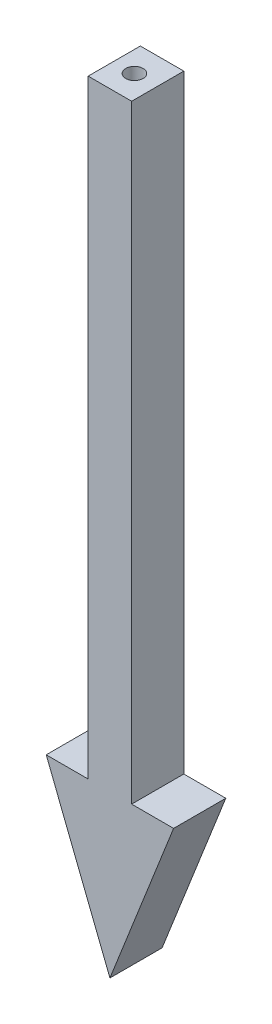
ISO-10303-21;
HEADER;
FILE_DESCRIPTION(('STEP AP214'),'2;1');
FILE_NAME('part.step','',(''),(''),'','','');
FILE_SCHEMA(('AUTOMOTIVE_DESIGN { 1 0 10303 214 1 1 1 1 }'));
ENDSEC;
DATA;
#1=APPLICATION_CONTEXT('core data for automotive mechanical design processes');
#2=APPLICATION_PROTOCOL_DEFINITION('international standard','automotive_design',2000,#1);
#3=PRODUCT_CONTEXT('',#1,'mechanical');
#4=PRODUCT('Part','Part','',(#3));
#5=PRODUCT_RELATED_PRODUCT_CATEGORY('part','',(#4));
#6=PRODUCT_DEFINITION_FORMATION('','',#4);
#7=PRODUCT_DEFINITION_CONTEXT('part definition',#1,'design');
#8=PRODUCT_DEFINITION('design','',#6,#7);
#9=PRODUCT_DEFINITION_SHAPE('','',#8);
#10=(LENGTH_UNIT() NAMED_UNIT(*) SI_UNIT(.MILLI.,.METRE.));
#11=(NAMED_UNIT(*) PLANE_ANGLE_UNIT() SI_UNIT($,.RADIAN.));
#12=(NAMED_UNIT(*) SI_UNIT($,.STERADIAN.) SOLID_ANGLE_UNIT());
#13=UNCERTAINTY_MEASURE_WITH_UNIT(LENGTH_MEASURE(1.E-05),#10,'distance_accuracy_value','');
#14=(GEOMETRIC_REPRESENTATION_CONTEXT(3) GLOBAL_UNCERTAINTY_ASSIGNED_CONTEXT((#13)) GLOBAL_UNIT_ASSIGNED_CONTEXT((#10,
#11,#12)) REPRESENTATION_CONTEXT('',''));
#15=CARTESIAN_POINT('',(0.,0.,0.));
#16=DIRECTION('',(0.,0.,1.));
#17=DIRECTION('',(1.,0.,0.));
#18=AXIS2_PLACEMENT_3D('',#15,#16,#17);
#19=CARTESIAN_POINT('',(-9.54116550646308,105.498159977998,12.));
#20=DIRECTION('',(0.,-1.,0.));
#21=DIRECTION('',(0.,0.,-1.));
#22=AXIS2_PLACEMENT_3D('',#19,#20,#21);
#23=PLANE('',#22);
#24=CARTESIAN_POINT('',(-4.74588635269599,105.498159977998,6.15354063467408));
#25=DIRECTION('',(0.,1.,0.));
#26=DIRECTION('',(0.,0.,1.));
#27=AXIS2_PLACEMENT_3D('',#24,#25,#26);
#28=CIRCLE('',#27,2.);
#29=CARTESIAN_POINT('',(-4.74588635269599,105.498159977998,8.15354063467408));
#30=VERTEX_POINT('',#29);
#31=EDGE_CURVE('E159',#30,#30,#28,.T.);
#32=ORIENTED_EDGE('',*,*,#31,.F.);
#33=EDGE_LOOP('',(#32));
#34=FACE_BOUND('',#33,.T.);
#35=DIRECTION('',(-1.,0.,0.));
#36=VECTOR('',#35,1.);
#37=CARTESIAN_POINT('',(-9.54116550646308,105.498159977998,0.));
#38=LINE('',#37,#36);
#39=CARTESIAN_POINT('',(0.458834493536922,105.498159977998,0.));
#40=VERTEX_POINT('',#39);
#41=CARTESIAN_POINT('',(-9.54116550646308,105.498159977998,0.));
#42=VERTEX_POINT('',#41);
#43=EDGE_CURVE('E124',#40,#42,#38,.T.);
#44=ORIENTED_EDGE('',*,*,#43,.T.);
#45=DIRECTION('',(0.,0.,-1.));
#46=VECTOR('',#45,1.);
#47=CARTESIAN_POINT('',(-9.54116550646308,105.498159977998,12.));
#48=LINE('',#47,#46);
#49=CARTESIAN_POINT('',(-9.54116550646308,105.498159977998,12.));
#50=VERTEX_POINT('',#49);
#51=EDGE_CURVE('E11',#50,#42,#48,.T.);
#52=ORIENTED_EDGE('',*,*,#51,.F.);
#53=DIRECTION('',(-1.,0.,0.));
#54=VECTOR('',#53,1.);
#55=CARTESIAN_POINT('',(-9.54116550646308,105.498159977998,12.));
#56=LINE('',#55,#54);
#57=CARTESIAN_POINT('',(0.458834493536922,105.498159977998,12.));
#58=VERTEX_POINT('',#57);
#59=EDGE_CURVE('E138',#58,#50,#56,.T.);
#60=ORIENTED_EDGE('',*,*,#59,.F.);
#61=DIRECTION('',(0.,0.,-1.));
#62=VECTOR('',#61,1.);
#63=CARTESIAN_POINT('',(0.458834493536922,105.498159977998,12.));
#64=LINE('',#63,#62);
#65=EDGE_CURVE('E120',#58,#40,#64,.T.);
#66=ORIENTED_EDGE('',*,*,#65,.T.);
#67=EDGE_LOOP('',(#44,#52,#60,#66));
#68=FACE_BOUND('',#67,.T.);
#69=ADVANCED_FACE('F33',(#34,#68),#23,.F.);
#70=CARTESIAN_POINT('',(-9.54116550646308,95.4981599779981,12.));
#71=DIRECTION('',(1.,0.,0.));
#72=DIRECTION('',(0.,0.,-1.));
#73=AXIS2_PLACEMENT_3D('',#70,#71,#72);
#74=PLANE('',#73);
#75=DIRECTION('',(0.,-1.,0.));
#76=VECTOR('',#75,1.);
#77=CARTESIAN_POINT('',(-9.54116550646308,95.4981599779981,0.));
#78=LINE('',#77,#76);
#79=CARTESIAN_POINT('',(-9.54116550646308,-34.5018400220019,0.));
#80=VERTEX_POINT('',#79);
#81=EDGE_CURVE('E127',#42,#80,#78,.T.);
#82=ORIENTED_EDGE('',*,*,#81,.T.);
#83=DIRECTION('',(0.,0.,-1.));
#84=VECTOR('',#83,1.);
#85=CARTESIAN_POINT('',(-9.54116550646308,-34.5018400220019,12.));
#86=LINE('',#85,#84);
#87=CARTESIAN_POINT('',(-9.54116550646308,-34.5018400220019,12.));
#88=VERTEX_POINT('',#87);
#89=EDGE_CURVE('E41',#88,#80,#86,.T.);
#90=ORIENTED_EDGE('',*,*,#89,.F.);
#91=DIRECTION('',(0.,-1.,0.));
#92=VECTOR('',#91,1.);
#93=CARTESIAN_POINT('',(-9.54116550646308,105.498159977998,12.));
#94=LINE('',#93,#92);
#95=EDGE_CURVE('E87',#50,#88,#94,.T.);
#96=ORIENTED_EDGE('',*,*,#95,.F.);
#97=ORIENTED_EDGE('',*,*,#51,.T.);
#98=EDGE_LOOP('',(#82,#90,#96,#97));
#99=FACE_BOUND('',#98,.T.);
#100=ADVANCED_FACE('F175',(#99),#74,.F.);
#101=CARTESIAN_POINT('',(-19.1929369408072,-34.5018400220019,12.));
#102=DIRECTION('',(0.,-1.,0.));
#103=DIRECTION('',(1.,0.,0.));
#104=AXIS2_PLACEMENT_3D('',#101,#102,#103);
#105=PLANE('',#104);
#106=DIRECTION('',(-1.,0.,0.));
#107=VECTOR('',#106,1.);
#108=CARTESIAN_POINT('',(-19.1929369408072,-34.5018400220019,0.));
#109=LINE('',#108,#107);
#110=CARTESIAN_POINT('',(-19.1929369408072,-34.5018400220019,0.));
#111=VERTEX_POINT('',#110);
#112=EDGE_CURVE('E130',#80,#111,#109,.T.);
#113=ORIENTED_EDGE('',*,*,#112,.T.);
#114=DIRECTION('',(0.,0.,-1.));
#115=VECTOR('',#114,1.);
#116=CARTESIAN_POINT('',(-19.1929369408072,-34.5018400220019,12.));
#117=LINE('',#116,#115);
#118=CARTESIAN_POINT('',(-19.1929369408072,-34.5018400220019,12.));
#119=VERTEX_POINT('',#118);
#120=EDGE_CURVE('E142',#119,#111,#117,.T.);
#121=ORIENTED_EDGE('',*,*,#120,.F.);
#122=DIRECTION('',(-1.,0.,0.));
#123=VECTOR('',#122,1.);
#124=CARTESIAN_POINT('',(-19.1929369408072,-34.5018400220019,12.));
#125=LINE('',#124,#123);
#126=EDGE_CURVE('E150',#88,#119,#125,.T.);
#127=ORIENTED_EDGE('',*,*,#126,.F.);
#128=ORIENTED_EDGE('',*,*,#89,.T.);
#129=EDGE_LOOP('',(#113,#121,#127,#128));
#130=FACE_BOUND('',#129,.T.);
#131=ADVANCED_FACE('F148',(#130),#105,.F.);
#132=CARTESIAN_POINT('',(-19.1929369408072,-34.5018400220019,12.));
#133=DIRECTION('',(0.930197160943089,0.367060269946798,0.));
#134=DIRECTION('',(-0.367060269946798,0.93019716094309,0.));
#135=AXIS2_PLACEMENT_3D('',#132,#133,#134);
#136=PLANE('',#135);
#137=DIRECTION('',(0.367060269946798,-0.930197160943089,0.));
#138=VECTOR('',#137,1.);
#139=CARTESIAN_POINT('',(-19.1929369408072,-34.5018400220019,0.));
#140=LINE('',#139,#138);
#141=CARTESIAN_POINT('',(-4.54116550646308,-71.6320807669056,0.));
#142=VERTEX_POINT('',#141);
#143=EDGE_CURVE('E132',#111,#142,#140,.T.);
#144=ORIENTED_EDGE('',*,*,#143,.T.);
#145=DIRECTION('',(0.,0.,-1.));
#146=VECTOR('',#145,1.);
#147=CARTESIAN_POINT('',(-4.54116550646308,-71.6320807669056,12.));
#148=LINE('',#147,#146);
#149=CARTESIAN_POINT('',(-4.54116550646308,-71.6320807669056,12.));
#150=VERTEX_POINT('',#149);
#151=EDGE_CURVE('E115',#150,#142,#148,.T.);
#152=ORIENTED_EDGE('',*,*,#151,.F.);
#153=DIRECTION('',(0.367060269946798,-0.930197160943089,0.));
#154=VECTOR('',#153,1.);
#155=CARTESIAN_POINT('',(-19.1929369408072,-34.5018400220019,12.));
#156=LINE('',#155,#154);
#157=EDGE_CURVE('E104',#119,#150,#156,.T.);
#158=ORIENTED_EDGE('',*,*,#157,.F.);
#159=ORIENTED_EDGE('',*,*,#120,.T.);
#160=EDGE_LOOP('',(#144,#152,#158,#159));
#161=FACE_BOUND('',#160,.T.);
#162=ADVANCED_FACE('F154',(#161),#136,.F.);
#163=CARTESIAN_POINT('',(-4.54116550646308,-71.6320807669056,12.));
#164=DIRECTION('',(-0.930197160943089,0.367060269946798,0.));
#165=DIRECTION('',(-0.367060269946798,-0.930197160943089,0.));
#166=AXIS2_PLACEMENT_3D('',#163,#164,#165);
#167=PLANE('',#166);
#168=DIRECTION('',(0.367060269946798,0.930197160943089,0.));
#169=VECTOR('',#168,1.);
#170=CARTESIAN_POINT('',(-4.54116550646308,-71.6320807669056,0.));
#171=LINE('',#170,#169);
#172=CARTESIAN_POINT('',(10.1106059278811,-34.5018400220019,0.));
#173=VERTEX_POINT('',#172);
#174=EDGE_CURVE('E113',#142,#173,#171,.T.);
#175=ORIENTED_EDGE('',*,*,#174,.T.);
#176=DIRECTION('',(0.,0.,-1.));
#177=VECTOR('',#176,1.);
#178=CARTESIAN_POINT('',(10.1106059278811,-34.5018400220019,12.));
#179=LINE('',#178,#177);
#180=CARTESIAN_POINT('',(10.1106059278811,-34.5018400220019,12.));
#181=VERTEX_POINT('',#180);
#182=EDGE_CURVE('E110',#181,#173,#179,.T.);
#183=ORIENTED_EDGE('',*,*,#182,.F.);
#184=DIRECTION('',(0.367060269946798,0.930197160943089,0.));
#185=VECTOR('',#184,1.);
#186=CARTESIAN_POINT('',(-4.54116550646308,-71.6320807669056,12.));
#187=LINE('',#186,#185);
#188=EDGE_CURVE('E97',#150,#181,#187,.T.);
#189=ORIENTED_EDGE('',*,*,#188,.F.);
#190=ORIENTED_EDGE('',*,*,#151,.T.);
#191=EDGE_LOOP('',(#175,#183,#189,#190));
#192=FACE_BOUND('',#191,.T.);
#193=ADVANCED_FACE('F111',(#192),#167,.F.);
#194=CARTESIAN_POINT('',(0.458834493536922,-34.5018400220019,12.));
#195=DIRECTION('',(0.,-1.,0.));
#196=DIRECTION('',(0.,0.,-1.));
#197=AXIS2_PLACEMENT_3D('',#194,#195,#196);
#198=PLANE('',#197);
#199=DIRECTION('',(-1.,0.,0.));
#200=VECTOR('',#199,1.);
#201=CARTESIAN_POINT('',(0.458834493536922,-34.5018400220019,0.));
#202=LINE('',#201,#200);
#203=CARTESIAN_POINT('',(0.458834493536922,-34.5018400220019,0.));
#204=VERTEX_POINT('',#203);
#205=EDGE_CURVE('E135',#173,#204,#202,.T.);
#206=ORIENTED_EDGE('',*,*,#205,.T.);
#207=DIRECTION('',(0.,0.,-1.));
#208=VECTOR('',#207,1.);
#209=CARTESIAN_POINT('',(0.458834493536922,-34.5018400220019,12.));
#210=LINE('',#209,#208);
#211=CARTESIAN_POINT('',(0.458834493536922,-34.5018400220019,12.));
#212=VERTEX_POINT('',#211);
#213=EDGE_CURVE('E116',#212,#204,#210,.T.);
#214=ORIENTED_EDGE('',*,*,#213,.F.);
#215=DIRECTION('',(-1.,0.,0.));
#216=VECTOR('',#215,1.);
#217=CARTESIAN_POINT('',(0.458834493536922,-34.5018400220019,12.));
#218=LINE('',#217,#216);
#219=EDGE_CURVE('E101',#181,#212,#218,.T.);
#220=ORIENTED_EDGE('',*,*,#219,.F.);
#221=ORIENTED_EDGE('',*,*,#182,.T.);
#222=EDGE_LOOP('',(#206,#214,#220,#221));
#223=FACE_BOUND('',#222,.T.);
#224=ADVANCED_FACE('F118',(#223),#198,.F.);
#225=CARTESIAN_POINT('',(0.458834493536922,105.498159977998,12.));
#226=DIRECTION('',(-1.,0.,0.));
#227=DIRECTION('',(0.,0.,1.));
#228=AXIS2_PLACEMENT_3D('',#225,#226,#227);
#229=PLANE('',#228);
#230=DIRECTION('',(0.,1.,0.));
#231=VECTOR('',#230,1.);
#232=CARTESIAN_POINT('',(0.458834493536922,105.498159977998,0.));
#233=LINE('',#232,#231);
#234=EDGE_CURVE('E75',#204,#40,#233,.T.);
#235=ORIENTED_EDGE('',*,*,#234,.T.);
#236=ORIENTED_EDGE('',*,*,#65,.F.);
#237=DIRECTION('',(0.,1.,0.));
#238=VECTOR('',#237,1.);
#239=CARTESIAN_POINT('',(0.458834493536922,95.4981599779981,12.));
#240=LINE('',#239,#238);
#241=EDGE_CURVE('E49',#212,#58,#240,.T.);
#242=ORIENTED_EDGE('',*,*,#241,.F.);
#243=ORIENTED_EDGE('',*,*,#213,.T.);
#244=EDGE_LOOP('',(#235,#236,#242,#243));
#245=FACE_BOUND('',#244,.T.);
#246=ADVANCED_FACE('F178',(#245),#229,.F.);
#247=CARTESIAN_POINT('',(0.,0.,12.));
#248=DIRECTION('',(0.,0.,-1.));
#249=DIRECTION('',(-1.,0.,0.));
#250=AXIS2_PLACEMENT_3D('',#247,#248,#249);
#251=PLANE('',#250);
#252=ORIENTED_EDGE('',*,*,#59,.T.);
#253=ORIENTED_EDGE('',*,*,#95,.T.);
#254=ORIENTED_EDGE('',*,*,#126,.T.);
#255=ORIENTED_EDGE('',*,*,#157,.T.);
#256=ORIENTED_EDGE('',*,*,#188,.T.);
#257=ORIENTED_EDGE('',*,*,#219,.T.);
#258=ORIENTED_EDGE('',*,*,#241,.T.);
#259=EDGE_LOOP('',(#252,#253,#254,#255,#256,#257,#258));
#260=FACE_BOUND('',#259,.T.);
#261=ADVANCED_FACE('F99',(#260),#251,.F.);
#262=CARTESIAN_POINT('',(0.,0.,0.));
#263=DIRECTION('',(0.,0.,-1.));
#264=DIRECTION('',(-1.,0.,0.));
#265=AXIS2_PLACEMENT_3D('',#262,#263,#264);
#266=PLANE('',#265);
#267=ORIENTED_EDGE('',*,*,#43,.F.);
#268=ORIENTED_EDGE('',*,*,#234,.F.);
#269=ORIENTED_EDGE('',*,*,#205,.F.);
#270=ORIENTED_EDGE('',*,*,#174,.F.);
#271=ORIENTED_EDGE('',*,*,#143,.F.);
#272=ORIENTED_EDGE('',*,*,#112,.F.);
#273=ORIENTED_EDGE('',*,*,#81,.F.);
#274=EDGE_LOOP('',(#267,#268,#269,#270,#271,#272,#273));
#275=FACE_BOUND('',#274,.T.);
#276=ADVANCED_FACE('F152',(#275),#266,.T.);
#277=CARTESIAN_POINT('',(-4.74588635269599,95.4981599779981,6.15354063467408));
#278=DIRECTION('',(0.,1.,0.));
#279=DIRECTION('',(0.,0.,1.));
#280=AXIS2_PLACEMENT_3D('',#277,#278,#279);
#281=CYLINDRICAL_SURFACE('',#280,2.);
#282=CARTESIAN_POINT('',(-4.74588635269599,95.4981599779981,6.15354063467408));
#283=DIRECTION('',(0.,1.,0.));
#284=DIRECTION('',(0.,0.,1.));
#285=AXIS2_PLACEMENT_3D('',#282,#283,#284);
#286=CIRCLE('',#285,2.);
#287=CARTESIAN_POINT('',(-4.74588635269599,95.4981599779981,8.15354063467408));
#288=VERTEX_POINT('',#287);
#289=EDGE_CURVE('E128',#288,#288,#286,.T.);
#290=ORIENTED_EDGE('',*,*,#289,.F.);
#291=EDGE_LOOP('',(#290));
#292=FACE_BOUND('',#291,.T.);
#293=ORIENTED_EDGE('',*,*,#31,.T.);
#294=EDGE_LOOP('',(#293));
#295=FACE_BOUND('',#294,.T.);
#296=ADVANCED_FACE('F167',(#292,#295),#281,.F.);
#297=CARTESIAN_POINT('',(-4.74588635269599,95.4981599779981,6.15354063467408));
#298=DIRECTION('',(0.,1.,0.));
#299=DIRECTION('',(0.,0.,1.));
#300=AXIS2_PLACEMENT_3D('',#297,#298,#299);
#301=PLANE('',#300);
#302=ORIENTED_EDGE('',*,*,#289,.T.);
#303=EDGE_LOOP('',(#302));
#304=FACE_BOUND('',#303,.T.);
#305=ADVANCED_FACE('F165',(#304),#301,.T.);
#306=CLOSED_SHELL('',(#69,#100,#131,#162,#193,#224,#246,#261,#276,#296,#305));
#307=MANIFOLD_SOLID_BREP('B2',#306);
#308=ADVANCED_BREP_SHAPE_REPRESENTATION('',(#18,#307),#14);
#309=SHAPE_DEFINITION_REPRESENTATION(#9,#308);
ENDSEC;
END-ISO-10303-21;
